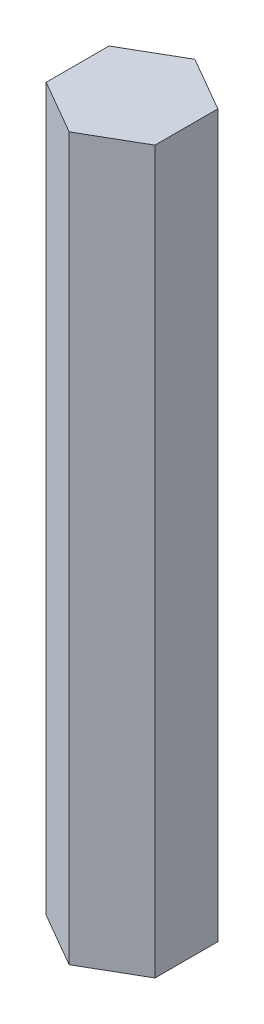
ISO-10303-21;
HEADER;
FILE_DESCRIPTION(('STEP AP214'),'2;1');
FILE_NAME('part.step','',(''),(''),'','','');
FILE_SCHEMA(('AUTOMOTIVE_DESIGN { 1 0 10303 214 1 1 1 1 }'));
ENDSEC;
DATA;
#1=APPLICATION_CONTEXT('core data for automotive mechanical design processes');
#2=APPLICATION_PROTOCOL_DEFINITION('international standard','automotive_design',2000,#1);
#3=PRODUCT_CONTEXT('',#1,'mechanical');
#4=PRODUCT('Part','Part','',(#3));
#5=PRODUCT_RELATED_PRODUCT_CATEGORY('part','',(#4));
#6=PRODUCT_DEFINITION_FORMATION('','',#4);
#7=PRODUCT_DEFINITION_CONTEXT('part definition',#1,'design');
#8=PRODUCT_DEFINITION('design','',#6,#7);
#9=PRODUCT_DEFINITION_SHAPE('','',#8);
#10=(LENGTH_UNIT() NAMED_UNIT(*) SI_UNIT(.MILLI.,.METRE.));
#11=(NAMED_UNIT(*) PLANE_ANGLE_UNIT() SI_UNIT($,.RADIAN.));
#12=(NAMED_UNIT(*) SI_UNIT($,.STERADIAN.) SOLID_ANGLE_UNIT());
#13=UNCERTAINTY_MEASURE_WITH_UNIT(LENGTH_MEASURE(1.E-05),#10,'distance_accuracy_value','');
#14=(GEOMETRIC_REPRESENTATION_CONTEXT(3) GLOBAL_UNCERTAINTY_ASSIGNED_CONTEXT((#13)) GLOBAL_UNIT_ASSIGNED_CONTEXT((#10,
#11,#12)) REPRESENTATION_CONTEXT('',''));
#15=CARTESIAN_POINT('',(0.,0.,0.));
#16=DIRECTION('',(0.,0.,1.));
#17=DIRECTION('',(1.,0.,0.));
#18=AXIS2_PLACEMENT_3D('',#15,#16,#17);
#19=CARTESIAN_POINT('',(3.79449030668152,33.528,-3.65125));
#20=DIRECTION('',(-0.5,0.,0.866025403784439));
#21=DIRECTION('',(0.866025403784439,0.,0.5));
#22=AXIS2_PLACEMENT_3D('',#19,#20,#21);
#23=PLANE('',#22);
#24=DIRECTION('',(-0.866025403784439,0.,-0.5));
#25=VECTOR('',#24,1.);
#26=CARTESIAN_POINT('',(3.79449030668152,0.,-3.65125));
#27=LINE('',#26,#25);
#28=CARTESIAN_POINT('',(3.79449030668152,0.,-3.65125));
#29=VERTEX_POINT('',#28);
#30=CARTESIAN_POINT('',(1.26483010222717,0.,-5.11175));
#31=VERTEX_POINT('',#30);
#32=EDGE_CURVE('E118',#29,#31,#27,.T.);
#33=ORIENTED_EDGE('',*,*,#32,.T.);
#34=DIRECTION('',(0.,-1.,0.));
#35=VECTOR('',#34,1.);
#36=CARTESIAN_POINT('',(1.26483010222717,33.528,-5.11175));
#37=LINE('',#36,#35);
#38=CARTESIAN_POINT('',(1.26483010222717,33.528,-5.11175));
#39=VERTEX_POINT('',#38);
#40=EDGE_CURVE('E11',#39,#31,#37,.T.);
#41=ORIENTED_EDGE('',*,*,#40,.F.);
#42=DIRECTION('',(-0.866025403784439,0.,-0.5));
#43=VECTOR('',#42,1.);
#44=CARTESIAN_POINT('',(3.79449030668152,33.528,-3.65125));
#45=LINE('',#44,#43);
#46=CARTESIAN_POINT('',(3.79449030668152,33.528,-3.65125));
#47=VERTEX_POINT('',#46);
#48=EDGE_CURVE('E128',#47,#39,#45,.T.);
#49=ORIENTED_EDGE('',*,*,#48,.F.);
#50=DIRECTION('',(0.,-1.,0.));
#51=VECTOR('',#50,1.);
#52=CARTESIAN_POINT('',(3.79449030668152,33.528,-3.65125));
#53=LINE('',#52,#51);
#54=EDGE_CURVE('E114',#47,#29,#53,.T.);
#55=ORIENTED_EDGE('',*,*,#54,.T.);
#56=EDGE_LOOP('',(#33,#41,#49,#55));
#57=FACE_BOUND('',#56,.T.);
#58=ADVANCED_FACE('F34',(#57),#23,.F.);
#59=CARTESIAN_POINT('',(1.26483010222717,33.528,-5.11175));
#60=DIRECTION('',(0.5,0.,0.866025403784439));
#61=DIRECTION('',(0.866025403784439,0.,-0.5));
#62=AXIS2_PLACEMENT_3D('',#59,#60,#61);
#63=PLANE('',#62);
#64=DIRECTION('',(-0.866025403784439,0.,0.5));
#65=VECTOR('',#64,1.);
#66=CARTESIAN_POINT('',(1.26483010222717,0.,-5.11175));
#67=LINE('',#66,#65);
#68=CARTESIAN_POINT('',(-1.26483010222717,0.,-3.65125));
#69=VERTEX_POINT('',#68);
#70=EDGE_CURVE('E121',#31,#69,#67,.T.);
#71=ORIENTED_EDGE('',*,*,#70,.T.);
#72=DIRECTION('',(0.,-1.,0.));
#73=VECTOR('',#72,1.);
#74=CARTESIAN_POINT('',(-1.26483010222717,33.528,-3.65125));
#75=LINE('',#74,#73);
#76=CARTESIAN_POINT('',(-1.26483010222717,33.528,-3.65125));
#77=VERTEX_POINT('',#76);
#78=EDGE_CURVE('E42',#77,#69,#75,.T.);
#79=ORIENTED_EDGE('',*,*,#78,.F.);
#80=DIRECTION('',(-0.866025403784439,0.,0.5));
#81=VECTOR('',#80,1.);
#82=CARTESIAN_POINT('',(1.26483010222717,33.528,-5.11175));
#83=LINE('',#82,#81);
#84=EDGE_CURVE('E87',#39,#77,#83,.T.);
#85=ORIENTED_EDGE('',*,*,#84,.F.);
#86=ORIENTED_EDGE('',*,*,#40,.T.);
#87=EDGE_LOOP('',(#71,#79,#85,#86));
#88=FACE_BOUND('',#87,.T.);
#89=ADVANCED_FACE('F152',(#88),#63,.F.);
#90=CARTESIAN_POINT('',(-1.26483010222717,33.528,-3.65125));
#91=DIRECTION('',(1.,0.,0.));
#92=DIRECTION('',(0.,0.,-1.));
#93=AXIS2_PLACEMENT_3D('',#90,#91,#92);
#94=PLANE('',#93);
#95=DIRECTION('',(0.,0.,1.));
#96=VECTOR('',#95,1.);
#97=CARTESIAN_POINT('',(-1.26483010222717,0.,-3.65125));
#98=LINE('',#97,#96);
#99=CARTESIAN_POINT('',(-1.26483010222717,0.,-0.73025));
#100=VERTEX_POINT('',#99);
#101=EDGE_CURVE('E123',#69,#100,#98,.T.);
#102=ORIENTED_EDGE('',*,*,#101,.T.);
#103=DIRECTION('',(0.,-1.,0.));
#104=VECTOR('',#103,1.);
#105=CARTESIAN_POINT('',(-1.26483010222717,33.528,-0.73025));
#106=LINE('',#105,#104);
#107=CARTESIAN_POINT('',(-1.26483010222717,33.528,-0.73025));
#108=VERTEX_POINT('',#107);
#109=EDGE_CURVE('E109',#108,#100,#106,.T.);
#110=ORIENTED_EDGE('',*,*,#109,.F.);
#111=DIRECTION('',(0.,0.,1.));
#112=VECTOR('',#111,1.);
#113=CARTESIAN_POINT('',(-1.26483010222717,33.528,-3.65125));
#114=LINE('',#113,#112);
#115=EDGE_CURVE('E100',#77,#108,#114,.T.);
#116=ORIENTED_EDGE('',*,*,#115,.F.);
#117=ORIENTED_EDGE('',*,*,#78,.T.);
#118=EDGE_LOOP('',(#102,#110,#116,#117));
#119=FACE_BOUND('',#118,.T.);
#120=ADVANCED_FACE('F134',(#119),#94,.F.);
#121=CARTESIAN_POINT('',(-1.26483010222717,33.528,-0.73025));
#122=DIRECTION('',(0.5,0.,-0.866025403784439));
#123=DIRECTION('',(-0.866025403784439,0.,-0.5));
#124=AXIS2_PLACEMENT_3D('',#121,#122,#123);
#125=PLANE('',#124);
#126=DIRECTION('',(0.866025403784439,0.,0.5));
#127=VECTOR('',#126,1.);
#128=CARTESIAN_POINT('',(-1.26483010222717,0.,-0.73025));
#129=LINE('',#128,#127);
#130=CARTESIAN_POINT('',(1.26483010222717,0.,0.73025));
#131=VERTEX_POINT('',#130);
#132=EDGE_CURVE('E108',#100,#131,#129,.T.);
#133=ORIENTED_EDGE('',*,*,#132,.T.);
#134=DIRECTION('',(0.,-1.,0.));
#135=VECTOR('',#134,1.);
#136=CARTESIAN_POINT('',(1.26483010222717,33.528,0.73025));
#137=LINE('',#136,#135);
#138=CARTESIAN_POINT('',(1.26483010222717,33.528,0.73025));
#139=VERTEX_POINT('',#138);
#140=EDGE_CURVE('E105',#139,#131,#137,.T.);
#141=ORIENTED_EDGE('',*,*,#140,.F.);
#142=DIRECTION('',(0.866025403784439,0.,0.5));
#143=VECTOR('',#142,1.);
#144=CARTESIAN_POINT('',(-1.26483010222717,33.528,-0.73025));
#145=LINE('',#144,#143);
#146=EDGE_CURVE('E94',#108,#139,#145,.T.);
#147=ORIENTED_EDGE('',*,*,#146,.F.);
#148=ORIENTED_EDGE('',*,*,#109,.T.);
#149=EDGE_LOOP('',(#133,#141,#147,#148));
#150=FACE_BOUND('',#149,.T.);
#151=ADVANCED_FACE('F106',(#150),#125,.F.);
#152=CARTESIAN_POINT('',(1.26483010222717,33.528,0.73025));
#153=DIRECTION('',(-0.5,0.,-0.866025403784439));
#154=DIRECTION('',(-0.866025403784439,0.,0.5));
#155=AXIS2_PLACEMENT_3D('',#152,#153,#154);
#156=PLANE('',#155);
#157=DIRECTION('',(0.866025403784439,0.,-0.5));
#158=VECTOR('',#157,1.);
#159=CARTESIAN_POINT('',(1.26483010222717,0.,0.73025));
#160=LINE('',#159,#158);
#161=CARTESIAN_POINT('',(3.79449030668152,0.,-0.73025));
#162=VERTEX_POINT('',#161);
#163=EDGE_CURVE('E73',#131,#162,#160,.T.);
#164=ORIENTED_EDGE('',*,*,#163,.T.);
#165=DIRECTION('',(0.,-1.,0.));
#166=VECTOR('',#165,1.);
#167=CARTESIAN_POINT('',(3.79449030668152,33.528,-0.73025));
#168=LINE('',#167,#166);
#169=CARTESIAN_POINT('',(3.79449030668152,33.528,-0.73025));
#170=VERTEX_POINT('',#169);
#171=EDGE_CURVE('E110',#170,#162,#168,.T.);
#172=ORIENTED_EDGE('',*,*,#171,.F.);
#173=DIRECTION('',(0.866025403784439,0.,-0.5));
#174=VECTOR('',#173,1.);
#175=CARTESIAN_POINT('',(1.26483010222717,33.528,0.73025));
#176=LINE('',#175,#174);
#177=EDGE_CURVE('E98',#139,#170,#176,.T.);
#178=ORIENTED_EDGE('',*,*,#177,.F.);
#179=ORIENTED_EDGE('',*,*,#140,.T.);
#180=EDGE_LOOP('',(#164,#172,#178,#179));
#181=FACE_BOUND('',#180,.T.);
#182=ADVANCED_FACE('F112',(#181),#156,.F.);
#183=CARTESIAN_POINT('',(3.79449030668152,33.528,-0.73025));
#184=DIRECTION('',(-1.,0.,0.));
#185=DIRECTION('',(0.,0.,1.));
#186=AXIS2_PLACEMENT_3D('',#183,#184,#185);
#187=PLANE('',#186);
#188=DIRECTION('',(0.,0.,-1.));
#189=VECTOR('',#188,1.);
#190=CARTESIAN_POINT('',(3.79449030668152,0.,-0.73025));
#191=LINE('',#190,#189);
#192=EDGE_CURVE('E79',#162,#29,#191,.T.);
#193=ORIENTED_EDGE('',*,*,#192,.T.);
#194=ORIENTED_EDGE('',*,*,#54,.F.);
#195=DIRECTION('',(0.,0.,-1.));
#196=VECTOR('',#195,1.);
#197=CARTESIAN_POINT('',(3.79449030668152,33.528,-0.73025));
#198=LINE('',#197,#196);
#199=EDGE_CURVE('E50',#170,#47,#198,.T.);
#200=ORIENTED_EDGE('',*,*,#199,.F.);
#201=ORIENTED_EDGE('',*,*,#171,.T.);
#202=EDGE_LOOP('',(#193,#194,#200,#201));
#203=FACE_BOUND('',#202,.T.);
#204=ADVANCED_FACE('F141',(#203),#187,.F.);
#205=CARTESIAN_POINT('',(0.,33.528,0.));
#206=DIRECTION('',(0.,1.,0.));
#207=DIRECTION('',(0.,0.,1.));
#208=AXIS2_PLACEMENT_3D('',#205,#206,#207);
#209=PLANE('',#208);
#210=ORIENTED_EDGE('',*,*,#48,.T.);
#211=ORIENTED_EDGE('',*,*,#84,.T.);
#212=ORIENTED_EDGE('',*,*,#115,.T.);
#213=ORIENTED_EDGE('',*,*,#146,.T.);
#214=ORIENTED_EDGE('',*,*,#177,.T.);
#215=ORIENTED_EDGE('',*,*,#199,.T.);
#216=EDGE_LOOP('',(#210,#211,#212,#213,#214,#215));
#217=FACE_BOUND('',#216,.T.);
#218=ADVANCED_FACE('F96',(#217),#209,.T.);
#219=CARTESIAN_POINT('',(0.,0.,0.));
#220=DIRECTION('',(0.,1.,0.));
#221=DIRECTION('',(0.,0.,1.));
#222=AXIS2_PLACEMENT_3D('',#219,#220,#221);
#223=PLANE('',#222);
#224=ORIENTED_EDGE('',*,*,#32,.F.);
#225=ORIENTED_EDGE('',*,*,#192,.F.);
#226=ORIENTED_EDGE('',*,*,#163,.F.);
#227=ORIENTED_EDGE('',*,*,#132,.F.);
#228=ORIENTED_EDGE('',*,*,#101,.F.);
#229=ORIENTED_EDGE('',*,*,#70,.F.);
#230=EDGE_LOOP('',(#224,#225,#226,#227,#228,#229));
#231=FACE_BOUND('',#230,.T.);
#232=ADVANCED_FACE('F137',(#231),#223,.F.);
#233=CLOSED_SHELL('',(#58,#89,#120,#151,#182,#204,#218,#232));
#234=MANIFOLD_SOLID_BREP('B2',#233);
#235=ADVANCED_BREP_SHAPE_REPRESENTATION('',(#18,#234),#14);
#236=SHAPE_DEFINITION_REPRESENTATION(#9,#235);
ENDSEC;
END-ISO-10303-21;
